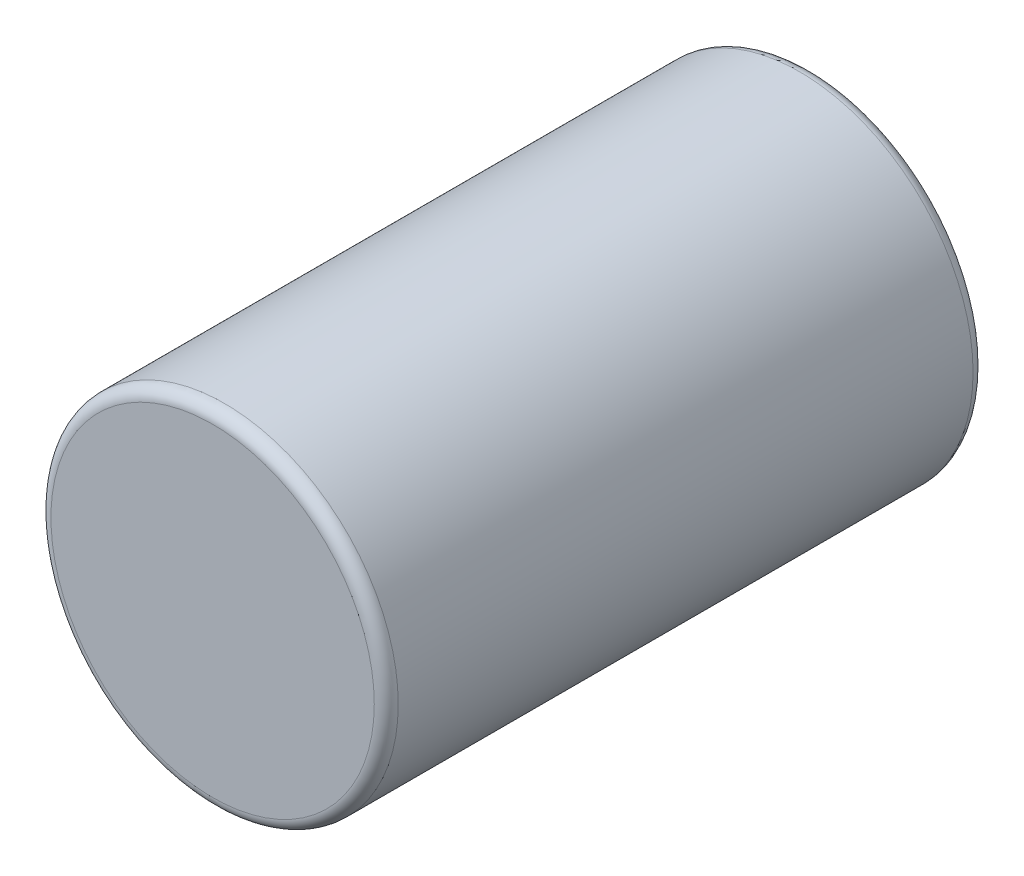
ISO-10303-21;
HEADER;
FILE_DESCRIPTION(('STEP AP214'),'2;1');
FILE_NAME('part.step','',(''),(''),'','','');
FILE_SCHEMA(('AUTOMOTIVE_DESIGN { 1 0 10303 214 1 1 1 1 }'));
ENDSEC;
DATA;
#1=APPLICATION_CONTEXT('core data for automotive mechanical design processes');
#2=APPLICATION_PROTOCOL_DEFINITION('international standard','automotive_design',2000,#1);
#3=PRODUCT_CONTEXT('',#1,'mechanical');
#4=PRODUCT('Part','Part','',(#3));
#5=PRODUCT_RELATED_PRODUCT_CATEGORY('part','',(#4));
#6=PRODUCT_DEFINITION_FORMATION('','',#4);
#7=PRODUCT_DEFINITION_CONTEXT('part definition',#1,'design');
#8=PRODUCT_DEFINITION('design','',#6,#7);
#9=PRODUCT_DEFINITION_SHAPE('','',#8);
#10=(LENGTH_UNIT() NAMED_UNIT(*) SI_UNIT(.MILLI.,.METRE.));
#11=(NAMED_UNIT(*) PLANE_ANGLE_UNIT() SI_UNIT($,.RADIAN.));
#12=(NAMED_UNIT(*) SI_UNIT($,.STERADIAN.) SOLID_ANGLE_UNIT());
#13=UNCERTAINTY_MEASURE_WITH_UNIT(LENGTH_MEASURE(1.E-05),#10,'distance_accuracy_value','');
#14=(GEOMETRIC_REPRESENTATION_CONTEXT(3) GLOBAL_UNCERTAINTY_ASSIGNED_CONTEXT((#13)) GLOBAL_UNIT_ASSIGNED_CONTEXT((#10,
#11,#12)) REPRESENTATION_CONTEXT('',''));
#15=CARTESIAN_POINT('',(0.,0.,0.));
#16=DIRECTION('',(0.,0.,1.));
#17=DIRECTION('',(1.,0.,0.));
#18=AXIS2_PLACEMENT_3D('',#15,#16,#17);
#19=CARTESIAN_POINT('',(0.,0.,2.5));
#20=DIRECTION('',(0.,0.,-1.));
#21=DIRECTION('',(-1.,0.,0.));
#22=AXIS2_PLACEMENT_3D('',#19,#20,#21);
#23=CYLINDRICAL_SURFACE('',#22,0.725);
#24=CARTESIAN_POINT('',(0.,0.,0.0500000000000001));
#25=DIRECTION('',(0.,0.,1.));
#26=DIRECTION('',(1.,0.,0.));
#27=AXIS2_PLACEMENT_3D('',#24,#25,#26);
#28=CIRCLE('',#27,0.725);
#29=CARTESIAN_POINT('',(0.725,0.,0.0500000000000001));
#30=VERTEX_POINT('',#29);
#31=EDGE_CURVE('E41',#30,#30,#28,.T.);
#32=ORIENTED_EDGE('',*,*,#31,.T.);
#33=EDGE_LOOP('',(#32));
#34=FACE_BOUND('',#33,.T.);
#35=CARTESIAN_POINT('',(0.,0.,2.45));
#36=DIRECTION('',(0.,0.,1.));
#37=DIRECTION('',(1.,0.,0.));
#38=AXIS2_PLACEMENT_3D('',#35,#36,#37);
#39=CIRCLE('',#38,0.725);
#40=CARTESIAN_POINT('',(0.725,0.,2.45));
#41=VERTEX_POINT('',#40);
#42=EDGE_CURVE('E45',#41,#41,#39,.F.);
#43=ORIENTED_EDGE('',*,*,#42,.T.);
#44=EDGE_LOOP('',(#43));
#45=FACE_BOUND('',#44,.T.);
#46=ADVANCED_FACE('F30',(#34,#45),#23,.T.);
#47=CARTESIAN_POINT('',(0.,0.,2.5));
#48=DIRECTION('',(0.,0.,1.));
#49=DIRECTION('',(1.,0.,0.));
#50=AXIS2_PLACEMENT_3D('',#47,#48,#49);
#51=PLANE('',#50);
#52=CARTESIAN_POINT('',(0.,0.,2.5));
#53=DIRECTION('',(0.,0.,1.));
#54=DIRECTION('',(1.,0.,0.));
#55=AXIS2_PLACEMENT_3D('',#52,#53,#54);
#56=CIRCLE('',#55,0.675);
#57=CARTESIAN_POINT('',(0.675,0.,2.5));
#58=VERTEX_POINT('',#57);
#59=EDGE_CURVE('E10',#58,#58,#56,.T.);
#60=ORIENTED_EDGE('',*,*,#59,.T.);
#61=EDGE_LOOP('',(#60));
#62=FACE_BOUND('',#61,.T.);
#63=ADVANCED_FACE('F61',(#62),#51,.T.);
#64=CARTESIAN_POINT('',(0.,0.,0.));
#65=DIRECTION('',(0.,0.,1.));
#66=DIRECTION('',(1.,0.,0.));
#67=AXIS2_PLACEMENT_3D('',#64,#65,#66);
#68=PLANE('',#67);
#69=CARTESIAN_POINT('',(0.,0.,0.));
#70=DIRECTION('',(0.,0.,1.));
#71=DIRECTION('',(1.,0.,0.));
#72=AXIS2_PLACEMENT_3D('',#69,#70,#71);
#73=CIRCLE('',#72,0.675);
#74=CARTESIAN_POINT('',(0.675,0.,0.));
#75=VERTEX_POINT('',#74);
#76=EDGE_CURVE('E37',#75,#75,#73,.F.);
#77=ORIENTED_EDGE('',*,*,#76,.T.);
#78=EDGE_LOOP('',(#77));
#79=FACE_BOUND('',#78,.T.);
#80=ADVANCED_FACE('F58',(#79),#68,.F.);
#81=CARTESIAN_POINT('',(0.,0.,0.0500000000000001));
#82=DIRECTION('',(0.,0.,1.));
#83=DIRECTION('',(1.,0.,0.));
#84=AXIS2_PLACEMENT_3D('',#81,#82,#83);
#85=TOROIDAL_SURFACE('',#84,0.675,0.05);
#86=ORIENTED_EDGE('',*,*,#76,.F.);
#87=EDGE_LOOP('',(#86));
#88=FACE_BOUND('',#87,.T.);
#89=ORIENTED_EDGE('',*,*,#31,.F.);
#90=EDGE_LOOP('',(#89));
#91=FACE_BOUND('',#90,.T.);
#92=ADVANCED_FACE('F54',(#88,#91),#85,.T.);
#93=CARTESIAN_POINT('',(0.,0.,2.45));
#94=DIRECTION('',(0.,0.,1.));
#95=DIRECTION('',(1.,0.,0.));
#96=AXIS2_PLACEMENT_3D('',#93,#94,#95);
#97=TOROIDAL_SURFACE('',#96,0.675,0.05);
#98=ORIENTED_EDGE('',*,*,#42,.F.);
#99=EDGE_LOOP('',(#98));
#100=FACE_BOUND('',#99,.T.);
#101=ORIENTED_EDGE('',*,*,#59,.F.);
#102=EDGE_LOOP('',(#101));
#103=FACE_BOUND('',#102,.T.);
#104=ADVANCED_FACE('F32',(#100,#103),#97,.T.);
#105=CLOSED_SHELL('',(#46,#63,#80,#92,#104));
#106=MANIFOLD_SOLID_BREP('B2',#105);
#107=ADVANCED_BREP_SHAPE_REPRESENTATION('',(#18,#106),#14);
#108=SHAPE_DEFINITION_REPRESENTATION(#9,#107);
ENDSEC;
END-ISO-10303-21;
